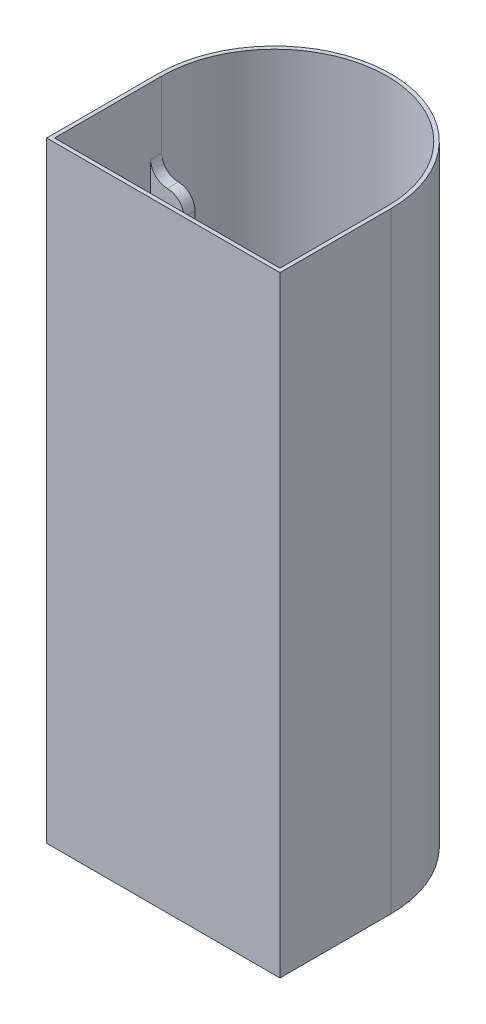
ISO-10303-21;
HEADER;
FILE_DESCRIPTION(('STEP AP214'),'2;1');
FILE_NAME('part.step','',(''),(''),'','','');
FILE_SCHEMA(('AUTOMOTIVE_DESIGN { 1 0 10303 214 1 1 1 1 }'));
ENDSEC;
DATA;
#1=APPLICATION_CONTEXT('core data for automotive mechanical design processes');
#2=APPLICATION_PROTOCOL_DEFINITION('international standard','automotive_design',2000,#1);
#3=PRODUCT_CONTEXT('',#1,'mechanical');
#4=PRODUCT('Part','Part','',(#3));
#5=PRODUCT_RELATED_PRODUCT_CATEGORY('part','',(#4));
#6=PRODUCT_DEFINITION_FORMATION('','',#4);
#7=PRODUCT_DEFINITION_CONTEXT('part definition',#1,'design');
#8=PRODUCT_DEFINITION('design','',#6,#7);
#9=PRODUCT_DEFINITION_SHAPE('','',#8);
#10=(LENGTH_UNIT() NAMED_UNIT(*) SI_UNIT(.MILLI.,.METRE.));
#11=(NAMED_UNIT(*) PLANE_ANGLE_UNIT() SI_UNIT($,.RADIAN.));
#12=(NAMED_UNIT(*) SI_UNIT($,.STERADIAN.) SOLID_ANGLE_UNIT());
#13=UNCERTAINTY_MEASURE_WITH_UNIT(LENGTH_MEASURE(1.E-05),#10,'distance_accuracy_value','');
#14=(GEOMETRIC_REPRESENTATION_CONTEXT(3) GLOBAL_UNCERTAINTY_ASSIGNED_CONTEXT((#13)) GLOBAL_UNIT_ASSIGNED_CONTEXT((#10,
#11,#12)) REPRESENTATION_CONTEXT('',''));
#15=CARTESIAN_POINT('',(0.,0.,0.));
#16=DIRECTION('',(0.,0.,1.));
#17=DIRECTION('',(1.,0.,0.));
#18=AXIS2_PLACEMENT_3D('',#15,#16,#17);
#19=CARTESIAN_POINT('',(0.416906474820143,0.700000000000006,-18.2922661870504));
#20=DIRECTION('',(0.,0.,1.));
#21=DIRECTION('',(1.,0.,0.));
#22=AXIS2_PLACEMENT_3D('',#19,#20,#21);
#23=PLANE('',#22);
#24=DIRECTION('',(0.,1.,0.));
#25=VECTOR('',#24,1.);
#26=CARTESIAN_POINT('',(-5.58309352517986,0.700000000000006,-18.2922661870504));
#27=LINE('',#26,#25);
#28=CARTESIAN_POINT('',(-5.58309352517986,0.700000000000006,-18.2922661870504));
#29=VERTEX_POINT('',#28);
#30=CARTESIAN_POINT('',(-5.58309352517986,92.,-18.2922661870504));
#31=VERTEX_POINT('',#30);
#32=EDGE_CURVE('E154',#29,#31,#27,.T.);
#33=ORIENTED_EDGE('',*,*,#32,.T.);
#34=CARTESIAN_POINT('',(-2.58309352517986,92.,-18.2922661870504));
#35=DIRECTION('',(0.,0.,1.));
#36=DIRECTION('',(1.,0.,0.));
#37=AXIS2_PLACEMENT_3D('',#34,#35,#36);
#38=CIRCLE('',#37,3.);
#39=CARTESIAN_POINT('',(-2.58309352517986,95.,-18.2922661870504));
#40=VERTEX_POINT('',#39);
#41=EDGE_CURVE('E59',#31,#40,#38,.F.);
#42=ORIENTED_EDGE('',*,*,#41,.T.);
#43=CARTESIAN_POINT('',(-2.58309352517986,98.,-18.2922661870504));
#44=DIRECTION('',(0.,0.,1.));
#45=DIRECTION('',(1.,0.,0.));
#46=AXIS2_PLACEMENT_3D('',#43,#44,#45);
#47=CIRCLE('',#46,3.);
#48=CARTESIAN_POINT('',(0.416906474820143,98.,-18.2922661870504));
#49=VERTEX_POINT('',#48);
#50=EDGE_CURVE('E42',#40,#49,#47,.T.);
#51=ORIENTED_EDGE('',*,*,#50,.T.);
#52=DIRECTION('',(0.,1.,0.));
#53=VECTOR('',#52,1.);
#54=CARTESIAN_POINT('',(0.416906474820143,0.700000000000006,-18.2922661870504));
#55=LINE('',#54,#53);
#56=CARTESIAN_POINT('',(0.416906474820143,0.700000000000006,-18.2922661870504));
#57=VERTEX_POINT('',#56);
#58=EDGE_CURVE('E50',#57,#49,#55,.T.);
#59=ORIENTED_EDGE('',*,*,#58,.F.);
#60=DIRECTION('',(1.,0.,0.));
#61=VECTOR('',#60,1.);
#62=CARTESIAN_POINT('',(0.416906474820143,0.700000000000006,-18.2922661870504));
#63=LINE('',#62,#61);
#64=EDGE_CURVE('E198',#29,#57,#63,.T.);
#65=ORIENTED_EDGE('',*,*,#64,.F.);
#66=EDGE_LOOP('',(#33,#42,#51,#59,#65));
#67=FACE_BOUND('',#66,.T.);
#68=ADVANCED_FACE('F33',(#67),#23,.F.);
#69=CARTESIAN_POINT('',(-5.58309352517986,0.700000000000006,-18.2922661870504));
#70=DIRECTION('',(1.,0.,0.));
#71=DIRECTION('',(0.,0.,-1.));
#72=AXIS2_PLACEMENT_3D('',#69,#70,#71);
#73=PLANE('',#72);
#74=DIRECTION('',(0.,1.,0.));
#75=VECTOR('',#74,1.);
#76=CARTESIAN_POINT('',(-5.58309352517986,0.700000000000006,-16.2922661870504));
#77=LINE('',#76,#75);
#78=CARTESIAN_POINT('',(-5.58309352517986,0.700000000000006,-16.2922661870504));
#79=VERTEX_POINT('',#78);
#80=CARTESIAN_POINT('',(-5.58309352517986,92.,-16.2922661870504));
#81=VERTEX_POINT('',#80);
#82=EDGE_CURVE('E137',#79,#81,#77,.T.);
#83=ORIENTED_EDGE('',*,*,#82,.T.);
#84=DIRECTION('',(0.,0.,1.));
#85=VECTOR('',#84,1.);
#86=CARTESIAN_POINT('',(-5.58309352517986,92.,-18.2922661870504));
#87=LINE('',#86,#85);
#88=EDGE_CURVE('E144',#81,#31,#87,.F.);
#89=ORIENTED_EDGE('',*,*,#88,.T.);
#90=ORIENTED_EDGE('',*,*,#32,.F.);
#91=DIRECTION('',(0.,0.,-1.));
#92=VECTOR('',#91,1.);
#93=CARTESIAN_POINT('',(-5.58309352517986,0.700000000000006,-18.2922661870504));
#94=LINE('',#93,#92);
#95=EDGE_CURVE('E152',#79,#29,#94,.T.);
#96=ORIENTED_EDGE('',*,*,#95,.F.);
#97=EDGE_LOOP('',(#83,#89,#90,#96));
#98=FACE_BOUND('',#97,.T.);
#99=ADVANCED_FACE('F149',(#98),#73,.F.);
#100=CARTESIAN_POINT('',(-5.58309352517986,0.700000000000006,-16.2922661870504));
#101=DIRECTION('',(0.,0.,-1.));
#102=DIRECTION('',(-1.,0.,0.));
#103=AXIS2_PLACEMENT_3D('',#100,#101,#102);
#104=PLANE('',#103);
#105=DIRECTION('',(0.,1.,0.));
#106=VECTOR('',#105,1.);
#107=CARTESIAN_POINT('',(0.416906474820142,0.700000000000006,-16.2922661870504));
#108=LINE('',#107,#106);
#109=CARTESIAN_POINT('',(0.416906474820142,0.700000000000006,-16.2922661870504));
#110=VERTEX_POINT('',#109);
#111=CARTESIAN_POINT('',(0.416906474820142,98.,-16.2922661870504));
#112=VERTEX_POINT('',#111);
#113=EDGE_CURVE('E155',#110,#112,#108,.T.);
#114=ORIENTED_EDGE('',*,*,#113,.T.);
#115=CARTESIAN_POINT('',(-2.58309352517986,98.,-16.2922661870504));
#116=DIRECTION('',(0.,0.,-1.));
#117=DIRECTION('',(-1.,0.,0.));
#118=AXIS2_PLACEMENT_3D('',#115,#116,#117);
#119=CIRCLE('',#118,3.);
#120=CARTESIAN_POINT('',(-2.58309352517986,95.,-16.2922661870504));
#121=VERTEX_POINT('',#120);
#122=EDGE_CURVE('E11',#112,#121,#119,.T.);
#123=ORIENTED_EDGE('',*,*,#122,.T.);
#124=CARTESIAN_POINT('',(-2.58309352517986,92.,-16.2922661870504));
#125=DIRECTION('',(0.,0.,-1.));
#126=DIRECTION('',(-1.,0.,0.));
#127=AXIS2_PLACEMENT_3D('',#124,#125,#126);
#128=CIRCLE('',#127,3.);
#129=EDGE_CURVE('E132',#121,#81,#128,.F.);
#130=ORIENTED_EDGE('',*,*,#129,.T.);
#131=ORIENTED_EDGE('',*,*,#82,.F.);
#132=DIRECTION('',(-1.,0.,0.));
#133=VECTOR('',#132,1.);
#134=CARTESIAN_POINT('',(-5.58309352517986,0.700000000000006,-16.2922661870504));
#135=LINE('',#134,#133);
#136=EDGE_CURVE('E218',#110,#79,#135,.T.);
#137=ORIENTED_EDGE('',*,*,#136,.F.);
#138=EDGE_LOOP('',(#114,#123,#130,#131,#137));
#139=FACE_BOUND('',#138,.T.);
#140=ADVANCED_FACE('F134',(#139),#104,.F.);
#141=CARTESIAN_POINT('',(0.416906474820143,0.700000000000006,-11.2922661870504));
#142=DIRECTION('',(0.,0.,1.));
#143=DIRECTION('',(1.,0.,0.));
#144=AXIS2_PLACEMENT_3D('',#141,#142,#143);
#145=PLANE('',#144);
#146=DIRECTION('',(0.,1.,0.));
#147=VECTOR('',#146,1.);
#148=CARTESIAN_POINT('',(-5.58309352517986,0.700000000000006,-11.2922661870504));
#149=LINE('',#148,#147);
#150=CARTESIAN_POINT('',(-5.58309352517986,0.700000000000006,-11.2922661870504));
#151=VERTEX_POINT('',#150);
#152=CARTESIAN_POINT('',(-5.58309352517986,92.,-11.2922661870504));
#153=VERTEX_POINT('',#152);
#154=EDGE_CURVE('E237',#151,#153,#149,.T.);
#155=ORIENTED_EDGE('',*,*,#154,.T.);
#156=CARTESIAN_POINT('',(-2.58309352517986,92.,-11.2922661870504));
#157=DIRECTION('',(0.,0.,1.));
#158=DIRECTION('',(1.,0.,0.));
#159=AXIS2_PLACEMENT_3D('',#156,#157,#158);
#160=CIRCLE('',#159,3.);
#161=CARTESIAN_POINT('',(-2.58309352517986,95.,-11.2922661870504));
#162=VERTEX_POINT('',#161);
#163=EDGE_CURVE('E145',#153,#162,#160,.F.);
#164=ORIENTED_EDGE('',*,*,#163,.T.);
#165=CARTESIAN_POINT('',(-2.58309352517986,98.,-11.2922661870504));
#166=DIRECTION('',(0.,0.,1.));
#167=DIRECTION('',(1.,0.,0.));
#168=AXIS2_PLACEMENT_3D('',#165,#166,#167);
#169=CIRCLE('',#168,3.);
#170=CARTESIAN_POINT('',(0.416906474820143,98.,-11.2922661870504));
#171=VERTEX_POINT('',#170);
#172=EDGE_CURVE('E172',#162,#171,#169,.T.);
#173=ORIENTED_EDGE('',*,*,#172,.T.);
#174=DIRECTION('',(0.,1.,0.));
#175=VECTOR('',#174,1.);
#176=CARTESIAN_POINT('',(0.416906474820143,0.700000000000006,-11.2922661870504));
#177=LINE('',#176,#175);
#178=CARTESIAN_POINT('',(0.416906474820143,0.700000000000006,-11.2922661870504));
#179=VERTEX_POINT('',#178);
#180=EDGE_CURVE('E235',#179,#171,#177,.T.);
#181=ORIENTED_EDGE('',*,*,#180,.F.);
#182=DIRECTION('',(1.,0.,0.));
#183=VECTOR('',#182,1.);
#184=CARTESIAN_POINT('',(0.416906474820143,0.700000000000006,-11.2922661870504));
#185=LINE('',#184,#183);
#186=EDGE_CURVE('E356',#151,#179,#185,.T.);
#187=ORIENTED_EDGE('',*,*,#186,.F.);
#188=EDGE_LOOP('',(#155,#164,#173,#181,#187));
#189=FACE_BOUND('',#188,.T.);
#190=ADVANCED_FACE('F333',(#189),#145,.F.);
#191=CARTESIAN_POINT('',(-5.58309352517986,0.700000000000006,-11.2922661870504));
#192=DIRECTION('',(1.,0.,0.));
#193=DIRECTION('',(0.,0.,-1.));
#194=AXIS2_PLACEMENT_3D('',#191,#192,#193);
#195=PLANE('',#194);
#196=DIRECTION('',(0.,1.,0.));
#197=VECTOR('',#196,1.);
#198=CARTESIAN_POINT('',(-5.58309352517986,0.700000000000006,-9.29226618705036));
#199=LINE('',#198,#197);
#200=CARTESIAN_POINT('',(-5.58309352517986,0.700000000000006,-9.29226618705036));
#201=VERTEX_POINT('',#200);
#202=CARTESIAN_POINT('',(-5.58309352517986,92.,-9.29226618705036));
#203=VERTEX_POINT('',#202);
#204=EDGE_CURVE('E240',#201,#203,#199,.T.);
#205=ORIENTED_EDGE('',*,*,#204,.T.);
#206=DIRECTION('',(0.,0.,1.));
#207=VECTOR('',#206,1.);
#208=CARTESIAN_POINT('',(-5.58309352517986,92.,-11.2922661870504));
#209=LINE('',#208,#207);
#210=EDGE_CURVE('E330',#203,#153,#209,.F.);
#211=ORIENTED_EDGE('',*,*,#210,.T.);
#212=ORIENTED_EDGE('',*,*,#154,.F.);
#213=DIRECTION('',(0.,0.,-1.));
#214=VECTOR('',#213,1.);
#215=CARTESIAN_POINT('',(-5.58309352517986,0.700000000000006,-11.2922661870504));
#216=LINE('',#215,#214);
#217=EDGE_CURVE('E444',#201,#151,#216,.T.);
#218=ORIENTED_EDGE('',*,*,#217,.F.);
#219=EDGE_LOOP('',(#205,#211,#212,#218));
#220=FACE_BOUND('',#219,.T.);
#221=ADVANCED_FACE('F487',(#220),#195,.F.);
#222=CARTESIAN_POINT('',(-5.58309352517986,0.700000000000006,-9.29226618705036));
#223=DIRECTION('',(0.,0.,-1.));
#224=DIRECTION('',(-1.,0.,0.));
#225=AXIS2_PLACEMENT_3D('',#222,#223,#224);
#226=PLANE('',#225);
#227=DIRECTION('',(0.,1.,0.));
#228=VECTOR('',#227,1.);
#229=CARTESIAN_POINT('',(0.416906474820143,0.700000000000006,-9.29226618705036));
#230=LINE('',#229,#228);
#231=CARTESIAN_POINT('',(0.416906474820143,0.700000000000006,-9.29226618705036));
#232=VERTEX_POINT('',#231);
#233=CARTESIAN_POINT('',(0.416906474820143,98.,-9.29226618705036));
#234=VERTEX_POINT('',#233);
#235=EDGE_CURVE('E243',#232,#234,#230,.T.);
#236=ORIENTED_EDGE('',*,*,#235,.T.);
#237=CARTESIAN_POINT('',(-2.58309352517986,98.,-9.29226618705036));
#238=DIRECTION('',(0.,0.,-1.));
#239=DIRECTION('',(-1.,0.,0.));
#240=AXIS2_PLACEMENT_3D('',#237,#238,#239);
#241=CIRCLE('',#240,3.);
#242=CARTESIAN_POINT('',(-2.58309352517986,95.,-9.29226618705036));
#243=VERTEX_POINT('',#242);
#244=EDGE_CURVE('E175',#234,#243,#241,.T.);
#245=ORIENTED_EDGE('',*,*,#244,.T.);
#246=CARTESIAN_POINT('',(-2.58309352517986,92.,-9.29226618705036));
#247=DIRECTION('',(0.,0.,-1.));
#248=DIRECTION('',(-1.,0.,0.));
#249=AXIS2_PLACEMENT_3D('',#246,#247,#248);
#250=CIRCLE('',#249,3.);
#251=EDGE_CURVE('E328',#243,#203,#250,.F.);
#252=ORIENTED_EDGE('',*,*,#251,.T.);
#253=ORIENTED_EDGE('',*,*,#204,.F.);
#254=DIRECTION('',(-1.,0.,0.));
#255=VECTOR('',#254,1.);
#256=CARTESIAN_POINT('',(-5.58309352517986,0.700000000000006,-9.29226618705036));
#257=LINE('',#256,#255);
#258=EDGE_CURVE('E441',#232,#201,#257,.T.);
#259=ORIENTED_EDGE('',*,*,#258,.F.);
#260=EDGE_LOOP('',(#236,#245,#252,#253,#259));
#261=FACE_BOUND('',#260,.T.);
#262=ADVANCED_FACE('F485',(#261),#226,.F.);
#263=CARTESIAN_POINT('',(-34.1830935251799,0.700000000000006,-9.29226618705036));
#264=DIRECTION('',(0.,0.,-1.));
#265=DIRECTION('',(-1.,0.,0.));
#266=AXIS2_PLACEMENT_3D('',#263,#264,#265);
#267=PLANE('',#266);
#268=DIRECTION('',(0.,1.,0.));
#269=VECTOR('',#268,1.);
#270=CARTESIAN_POINT('',(-34.1830935251799,0.700000000000006,-9.29226618705036));
#271=LINE('',#270,#269);
#272=CARTESIAN_POINT('',(-34.1830935251799,0.700000000000006,-9.29226618705036));
#273=VERTEX_POINT('',#272);
#274=CARTESIAN_POINT('',(-34.1830935251799,92.,-9.29226618705036));
#275=VERTEX_POINT('',#274);
#276=EDGE_CURVE('E253',#273,#275,#271,.T.);
#277=ORIENTED_EDGE('',*,*,#276,.T.);
#278=CARTESIAN_POINT('',(-37.1830935251799,92.,-9.29226618705036));
#279=DIRECTION('',(0.,0.,-1.));
#280=DIRECTION('',(-1.,0.,0.));
#281=AXIS2_PLACEMENT_3D('',#278,#279,#280);
#282=CIRCLE('',#281,3.);
#283=CARTESIAN_POINT('',(-37.1830935251799,95.,-9.29226618705036));
#284=VERTEX_POINT('',#283);
#285=EDGE_CURVE('E84',#275,#284,#282,.F.);
#286=ORIENTED_EDGE('',*,*,#285,.T.);
#287=CARTESIAN_POINT('',(-37.1830935251799,98.,-9.29226618705036));
#288=DIRECTION('',(0.,0.,-1.));
#289=DIRECTION('',(-1.,0.,0.));
#290=AXIS2_PLACEMENT_3D('',#287,#288,#289);
#291=CIRCLE('',#290,3.);
#292=CARTESIAN_POINT('',(-40.1830935251799,98.,-9.29226618705036));
#293=VERTEX_POINT('',#292);
#294=EDGE_CURVE('E159',#284,#293,#291,.T.);
#295=ORIENTED_EDGE('',*,*,#294,.T.);
#296=DIRECTION('',(0.,1.,0.));
#297=VECTOR('',#296,1.);
#298=CARTESIAN_POINT('',(-40.1830935251799,0.700000000000006,-9.29226618705036));
#299=LINE('',#298,#297);
#300=CARTESIAN_POINT('',(-40.1830935251799,0.700000000000006,-9.29226618705036));
#301=VERTEX_POINT('',#300);
#302=EDGE_CURVE('E251',#301,#293,#299,.T.);
#303=ORIENTED_EDGE('',*,*,#302,.F.);
#304=DIRECTION('',(-1.,0.,0.));
#305=VECTOR('',#304,1.);
#306=CARTESIAN_POINT('',(-34.1830935251799,0.700000000000006,-9.29226618705036));
#307=LINE('',#306,#305);
#308=EDGE_CURVE('E419',#273,#301,#307,.T.);
#309=ORIENTED_EDGE('',*,*,#308,.F.);
#310=EDGE_LOOP('',(#277,#286,#295,#303,#309));
#311=FACE_BOUND('',#310,.T.);
#312=ADVANCED_FACE('F413',(#311),#267,.F.);
#313=CARTESIAN_POINT('',(-34.1830935251799,0.700000000000006,-11.2922661870504));
#314=DIRECTION('',(-1.,0.,0.));
#315=DIRECTION('',(0.,0.,1.));
#316=AXIS2_PLACEMENT_3D('',#313,#314,#315);
#317=PLANE('',#316);
#318=DIRECTION('',(0.,1.,0.));
#319=VECTOR('',#318,1.);
#320=CARTESIAN_POINT('',(-34.1830935251799,0.700000000000006,-11.2922661870504));
#321=LINE('',#320,#319);
#322=CARTESIAN_POINT('',(-34.1830935251799,0.700000000000006,-11.2922661870504));
#323=VERTEX_POINT('',#322);
#324=CARTESIAN_POINT('',(-34.1830935251799,92.,-11.2922661870504));
#325=VERTEX_POINT('',#324);
#326=EDGE_CURVE('E255',#323,#325,#321,.T.);
#327=ORIENTED_EDGE('',*,*,#326,.T.);
#328=DIRECTION('',(0.,0.,-1.));
#329=VECTOR('',#328,1.);
#330=CARTESIAN_POINT('',(-34.1830935251799,92.,-9.29226618705036));
#331=LINE('',#330,#329);
#332=EDGE_CURVE('E308',#325,#275,#331,.F.);
#333=ORIENTED_EDGE('',*,*,#332,.T.);
#334=ORIENTED_EDGE('',*,*,#276,.F.);
#335=DIRECTION('',(0.,0.,1.));
#336=VECTOR('',#335,1.);
#337=CARTESIAN_POINT('',(-34.1830935251799,0.700000000000006,-11.2922661870504));
#338=LINE('',#337,#336);
#339=EDGE_CURVE('E406',#323,#273,#338,.T.);
#340=ORIENTED_EDGE('',*,*,#339,.F.);
#341=EDGE_LOOP('',(#327,#333,#334,#340));
#342=FACE_BOUND('',#341,.T.);
#343=ADVANCED_FACE('F403',(#342),#317,.F.);
#344=CARTESIAN_POINT('',(-40.1830935251799,0.700000000000006,-11.2922661870504));
#345=DIRECTION('',(0.,0.,1.));
#346=DIRECTION('',(1.,0.,0.));
#347=AXIS2_PLACEMENT_3D('',#344,#345,#346);
#348=PLANE('',#347);
#349=DIRECTION('',(0.,1.,0.));
#350=VECTOR('',#349,1.);
#351=CARTESIAN_POINT('',(-40.1830935251799,0.700000000000006,-11.2922661870504));
#352=LINE('',#351,#350);
#353=CARTESIAN_POINT('',(-40.1830935251799,0.700000000000006,-11.2922661870504));
#354=VERTEX_POINT('',#353);
#355=CARTESIAN_POINT('',(-40.1830935251799,98.,-11.2922661870504));
#356=VERTEX_POINT('',#355);
#357=EDGE_CURVE('E258',#354,#356,#352,.T.);
#358=ORIENTED_EDGE('',*,*,#357,.T.);
#359=CARTESIAN_POINT('',(-37.1830935251799,98.,-11.2922661870504));
#360=DIRECTION('',(0.,0.,1.));
#361=DIRECTION('',(1.,0.,0.));
#362=AXIS2_PLACEMENT_3D('',#359,#360,#361);
#363=CIRCLE('',#362,3.);
#364=CARTESIAN_POINT('',(-37.1830935251799,95.,-11.2922661870504));
#365=VERTEX_POINT('',#364);
#366=EDGE_CURVE('E164',#356,#365,#363,.T.);
#367=ORIENTED_EDGE('',*,*,#366,.T.);
#368=CARTESIAN_POINT('',(-37.1830935251799,92.,-11.2922661870504));
#369=DIRECTION('',(0.,0.,1.));
#370=DIRECTION('',(1.,0.,0.));
#371=AXIS2_PLACEMENT_3D('',#368,#369,#370);
#372=CIRCLE('',#371,3.);
#373=EDGE_CURVE('E302',#365,#325,#372,.F.);
#374=ORIENTED_EDGE('',*,*,#373,.T.);
#375=ORIENTED_EDGE('',*,*,#326,.F.);
#376=DIRECTION('',(1.,0.,0.));
#377=VECTOR('',#376,1.);
#378=CARTESIAN_POINT('',(-40.1830935251799,0.700000000000006,-11.2922661870504));
#379=LINE('',#378,#377);
#380=EDGE_CURVE('E433',#354,#323,#379,.T.);
#381=ORIENTED_EDGE('',*,*,#380,.F.);
#382=EDGE_LOOP('',(#358,#367,#374,#375,#381));
#383=FACE_BOUND('',#382,.T.);
#384=ADVANCED_FACE('F394',(#383),#348,.F.);
#385=CARTESIAN_POINT('',(-34.1830935251799,0.700000000000006,-16.2922661870504));
#386=DIRECTION('',(0.,0.,-1.));
#387=DIRECTION('',(-1.,0.,0.));
#388=AXIS2_PLACEMENT_3D('',#385,#386,#387);
#389=PLANE('',#388);
#390=DIRECTION('',(0.,1.,0.));
#391=VECTOR('',#390,1.);
#392=CARTESIAN_POINT('',(-34.1830935251799,0.700000000000006,-16.2922661870504));
#393=LINE('',#392,#391);
#394=CARTESIAN_POINT('',(-34.1830935251799,0.700000000000006,-16.2922661870504));
#395=VERTEX_POINT('',#394);
#396=CARTESIAN_POINT('',(-34.1830935251799,92.,-16.2922661870504));
#397=VERTEX_POINT('',#396);
#398=EDGE_CURVE('E262',#395,#397,#393,.T.);
#399=ORIENTED_EDGE('',*,*,#398,.T.);
#400=CARTESIAN_POINT('',(-37.1830935251799,92.,-16.2922661870504));
#401=DIRECTION('',(0.,0.,-1.));
#402=DIRECTION('',(-1.,0.,0.));
#403=AXIS2_PLACEMENT_3D('',#400,#401,#402);
#404=CIRCLE('',#403,3.);
#405=CARTESIAN_POINT('',(-37.1830935251799,95.,-16.2922661870504));
#406=VERTEX_POINT('',#405);
#407=EDGE_CURVE('E322',#397,#406,#404,.F.);
#408=ORIENTED_EDGE('',*,*,#407,.T.);
#409=CARTESIAN_POINT('',(-37.1830935251799,98.,-16.2922661870504));
#410=DIRECTION('',(0.,0.,-1.));
#411=DIRECTION('',(-1.,0.,0.));
#412=AXIS2_PLACEMENT_3D('',#409,#410,#411);
#413=CIRCLE('',#412,3.);
#414=CARTESIAN_POINT('',(-40.1830935251799,98.,-16.2922661870504));
#415=VERTEX_POINT('',#414);
#416=EDGE_CURVE('E167',#406,#415,#413,.T.);
#417=ORIENTED_EDGE('',*,*,#416,.T.);
#418=DIRECTION('',(0.,1.,0.));
#419=VECTOR('',#418,1.);
#420=CARTESIAN_POINT('',(-40.1830935251799,0.700000000000006,-16.2922661870504));
#421=LINE('',#420,#419);
#422=CARTESIAN_POINT('',(-40.1830935251799,0.700000000000006,-16.2922661870504));
#423=VERTEX_POINT('',#422);
#424=EDGE_CURVE('E260',#423,#415,#421,.T.);
#425=ORIENTED_EDGE('',*,*,#424,.F.);
#426=DIRECTION('',(-1.,0.,0.));
#427=VECTOR('',#426,1.);
#428=CARTESIAN_POINT('',(-34.1830935251799,0.700000000000006,-16.2922661870504));
#429=LINE('',#428,#427);
#430=EDGE_CURVE('E461',#395,#423,#429,.T.);
#431=ORIENTED_EDGE('',*,*,#430,.F.);
#432=EDGE_LOOP('',(#399,#408,#417,#425,#431));
#433=FACE_BOUND('',#432,.T.);
#434=ADVANCED_FACE('F509',(#433),#389,.F.);
#435=CARTESIAN_POINT('',(-34.1830935251799,0.700000000000006,-18.2922661870504));
#436=DIRECTION('',(-1.,0.,0.));
#437=DIRECTION('',(0.,0.,1.));
#438=AXIS2_PLACEMENT_3D('',#435,#436,#437);
#439=PLANE('',#438);
#440=DIRECTION('',(0.,1.,0.));
#441=VECTOR('',#440,1.);
#442=CARTESIAN_POINT('',(-34.1830935251799,0.700000000000006,-18.2922661870504));
#443=LINE('',#442,#441);
#444=CARTESIAN_POINT('',(-34.1830935251799,0.700000000000006,-18.2922661870504));
#445=VERTEX_POINT('',#444);
#446=CARTESIAN_POINT('',(-34.1830935251799,92.,-18.2922661870504));
#447=VERTEX_POINT('',#446);
#448=EDGE_CURVE('E216',#445,#447,#443,.T.);
#449=ORIENTED_EDGE('',*,*,#448,.T.);
#450=DIRECTION('',(0.,0.,-1.));
#451=VECTOR('',#450,1.);
#452=CARTESIAN_POINT('',(-34.1830935251799,92.,-16.2922661870504));
#453=LINE('',#452,#451);
#454=EDGE_CURVE('E319',#447,#397,#453,.F.);
#455=ORIENTED_EDGE('',*,*,#454,.T.);
#456=ORIENTED_EDGE('',*,*,#398,.F.);
#457=DIRECTION('',(0.,0.,1.));
#458=VECTOR('',#457,1.);
#459=CARTESIAN_POINT('',(-34.1830935251799,0.700000000000006,-18.2922661870504));
#460=LINE('',#459,#458);
#461=EDGE_CURVE('E458',#445,#395,#460,.T.);
#462=ORIENTED_EDGE('',*,*,#461,.F.);
#463=EDGE_LOOP('',(#449,#455,#456,#462));
#464=FACE_BOUND('',#463,.T.);
#465=ADVANCED_FACE('F506',(#464),#439,.F.);
#466=CARTESIAN_POINT('',(-40.1830935251799,0.700000000000006,-18.2922661870504));
#467=DIRECTION('',(0.,0.,1.));
#468=DIRECTION('',(1.,0.,0.));
#469=AXIS2_PLACEMENT_3D('',#466,#467,#468);
#470=PLANE('',#469);
#471=DIRECTION('',(0.,1.,0.));
#472=VECTOR('',#471,1.);
#473=CARTESIAN_POINT('',(-40.1830935251799,0.700000000000006,-18.2922661870504));
#474=LINE('',#473,#472);
#475=CARTESIAN_POINT('',(-40.1830935251799,0.700000000000006,-18.2922661870504));
#476=VERTEX_POINT('',#475);
#477=CARTESIAN_POINT('',(-40.1830935251799,98.,-18.2922661870504));
#478=VERTEX_POINT('',#477);
#479=EDGE_CURVE('E72',#476,#478,#474,.T.);
#480=ORIENTED_EDGE('',*,*,#479,.T.);
#481=CARTESIAN_POINT('',(-37.1830935251799,98.,-18.2922661870504));
#482=DIRECTION('',(0.,0.,1.));
#483=DIRECTION('',(1.,0.,0.));
#484=AXIS2_PLACEMENT_3D('',#481,#482,#483);
#485=CIRCLE('',#484,3.);
#486=CARTESIAN_POINT('',(-37.1830935251799,95.,-18.2922661870504));
#487=VERTEX_POINT('',#486);
#488=EDGE_CURVE('E170',#478,#487,#485,.T.);
#489=ORIENTED_EDGE('',*,*,#488,.T.);
#490=CARTESIAN_POINT('',(-37.1830935251799,92.,-18.2922661870504));
#491=DIRECTION('',(0.,0.,1.));
#492=DIRECTION('',(1.,0.,0.));
#493=AXIS2_PLACEMENT_3D('',#490,#491,#492);
#494=CIRCLE('',#493,3.);
#495=EDGE_CURVE('E317',#487,#447,#494,.F.);
#496=ORIENTED_EDGE('',*,*,#495,.T.);
#497=ORIENTED_EDGE('',*,*,#448,.F.);
#498=DIRECTION('',(1.,0.,0.));
#499=VECTOR('',#498,1.);
#500=CARTESIAN_POINT('',(-40.1830935251799,0.700000000000006,-18.2922661870504));
#501=LINE('',#500,#499);
#502=EDGE_CURVE('E211',#476,#445,#501,.T.);
#503=ORIENTED_EDGE('',*,*,#502,.F.);
#504=EDGE_LOOP('',(#480,#489,#496,#497,#503));
#505=FACE_BOUND('',#504,.T.);
#506=ADVANCED_FACE('F510',(#505),#470,.F.);
#507=CARTESIAN_POINT('',(-40.8830935251799,110.,1.70773381294964));
#508=DIRECTION('',(0.,0.,-1.));
#509=DIRECTION('',(-1.,0.,0.));
#510=AXIS2_PLACEMENT_3D('',#507,#508,#509);
#511=PLANE('',#510);
#512=DIRECTION('',(1.,0.,0.));
#513=VECTOR('',#512,1.);
#514=CARTESIAN_POINT('',(-40.8830935251799,0.,1.70773381294964));
#515=LINE('',#514,#513);
#516=CARTESIAN_POINT('',(-40.8830935251799,0.,1.70773381294964));
#517=VERTEX_POINT('',#516);
#518=CARTESIAN_POINT('',(1.11690647482014,0.,1.70773381294964));
#519=VERTEX_POINT('',#518);
#520=EDGE_CURVE('E201',#517,#519,#515,.T.);
#521=ORIENTED_EDGE('',*,*,#520,.T.);
#522=DIRECTION('',(0.,-1.,0.));
#523=VECTOR('',#522,1.);
#524=CARTESIAN_POINT('',(1.11690647482014,110.,1.70773381294964));
#525=LINE('',#524,#523);
#526=CARTESIAN_POINT('',(1.11690647482014,110.,1.70773381294964));
#527=VERTEX_POINT('',#526);
#528=EDGE_CURVE('E299',#527,#519,#525,.T.);
#529=ORIENTED_EDGE('',*,*,#528,.F.);
#530=DIRECTION('',(1.,0.,0.));
#531=VECTOR('',#530,1.);
#532=CARTESIAN_POINT('',(-40.8830935251799,110.,1.70773381294964));
#533=LINE('',#532,#531);
#534=CARTESIAN_POINT('',(-40.8830935251799,110.,1.70773381294964));
#535=VERTEX_POINT('',#534);
#536=EDGE_CURVE('E267',#535,#527,#533,.T.);
#537=ORIENTED_EDGE('',*,*,#536,.F.);
#538=DIRECTION('',(0.,-1.,0.));
#539=VECTOR('',#538,1.);
#540=CARTESIAN_POINT('',(-40.8830935251799,110.,1.70773381294964));
#541=LINE('',#540,#539);
#542=EDGE_CURVE('E280',#535,#517,#541,.T.);
#543=ORIENTED_EDGE('',*,*,#542,.T.);
#544=EDGE_LOOP('',(#521,#529,#537,#543));
#545=FACE_BOUND('',#544,.T.);
#546=ADVANCED_FACE('F563',(#545),#511,.F.);
#547=CARTESIAN_POINT('',(1.11690647482014,110.,1.70773381294964));
#548=DIRECTION('',(-1.,0.,0.));
#549=DIRECTION('',(0.,0.,1.));
#550=AXIS2_PLACEMENT_3D('',#547,#548,#549);
#551=PLANE('',#550);
#552=DIRECTION('',(0.,0.,-1.));
#553=VECTOR('',#552,1.);
#554=CARTESIAN_POINT('',(1.11690647482014,0.,1.70773381294964));
#555=LINE('',#554,#553);
#556=CARTESIAN_POINT('',(1.11690647482014,0.,-18.2922661870504));
#557=VERTEX_POINT('',#556);
#558=EDGE_CURVE('E283',#519,#557,#555,.T.);
#559=ORIENTED_EDGE('',*,*,#558,.T.);
#560=DIRECTION('',(0.,-1.,0.));
#561=VECTOR('',#560,1.);
#562=CARTESIAN_POINT('',(1.11690647482014,110.,-18.2922661870504));
#563=LINE('',#562,#561);
#564=CARTESIAN_POINT('',(1.11690647482014,110.,-18.2922661870504));
#565=VERTEX_POINT('',#564);
#566=EDGE_CURVE('E296',#565,#557,#563,.T.);
#567=ORIENTED_EDGE('',*,*,#566,.F.);
#568=DIRECTION('',(0.,0.,-1.));
#569=VECTOR('',#568,1.);
#570=CARTESIAN_POINT('',(1.11690647482014,110.,1.70773381294964));
#571=LINE('',#570,#569);
#572=EDGE_CURVE('E270',#527,#565,#571,.T.);
#573=ORIENTED_EDGE('',*,*,#572,.F.);
#574=ORIENTED_EDGE('',*,*,#528,.T.);
#575=EDGE_LOOP('',(#559,#567,#573,#574));
#576=FACE_BOUND('',#575,.T.);
#577=ADVANCED_FACE('F579',(#576),#551,.F.);
#578=CARTESIAN_POINT('',(-19.8830935251799,110.,-18.2922661870504));
#579=DIRECTION('',(0.,-1.,0.));
#580=DIRECTION('',(0.,0.,-1.));
#581=AXIS2_PLACEMENT_3D('',#578,#579,#580);
#582=CYLINDRICAL_SURFACE('',#581,21.);
#583=CARTESIAN_POINT('',(-19.8830935251799,0.,-18.2922661870504));
#584=DIRECTION('',(0.,1.,0.));
#585=DIRECTION('',(0.,0.,1.));
#586=AXIS2_PLACEMENT_3D('',#583,#584,#585);
#587=CIRCLE('',#586,21.);
#588=CARTESIAN_POINT('',(-40.8830935251799,0.,-18.2922661870504));
#589=VERTEX_POINT('',#588);
#590=EDGE_CURVE('E286',#557,#589,#587,.T.);
#591=ORIENTED_EDGE('',*,*,#590,.T.);
#592=DIRECTION('',(0.,-1.,0.));
#593=VECTOR('',#592,1.);
#594=CARTESIAN_POINT('',(-40.8830935251799,110.,-18.2922661870504));
#595=LINE('',#594,#593);
#596=CARTESIAN_POINT('',(-40.8830935251799,110.,-18.2922661870504));
#597=VERTEX_POINT('',#596);
#598=EDGE_CURVE('E293',#597,#589,#595,.T.);
#599=ORIENTED_EDGE('',*,*,#598,.F.);
#600=CARTESIAN_POINT('',(-19.8830935251799,110.,-18.2922661870504));
#601=DIRECTION('',(0.,1.,0.));
#602=DIRECTION('',(0.,0.,1.));
#603=AXIS2_PLACEMENT_3D('',#600,#601,#602);
#604=CIRCLE('',#603,21.);
#605=EDGE_CURVE('E274',#565,#597,#604,.T.);
#606=ORIENTED_EDGE('',*,*,#605,.F.);
#607=ORIENTED_EDGE('',*,*,#566,.T.);
#608=EDGE_LOOP('',(#591,#599,#606,#607));
#609=FACE_BOUND('',#608,.T.);
#610=ADVANCED_FACE('F575',(#609),#582,.T.);
#611=CARTESIAN_POINT('',(-40.8830935251799,110.,1.70773381294964));
#612=DIRECTION('',(-1.,0.,0.));
#613=DIRECTION('',(0.,0.,1.));
#614=AXIS2_PLACEMENT_3D('',#611,#612,#613);
#615=PLANE('',#614);
#616=CARTESIAN_POINT('',(-40.8830935251799,55.,-4.95893285371703));
#617=DIRECTION('',(-1.,0.,0.));
#618=DIRECTION('',(0.,0.,1.));
#619=AXIS2_PLACEMENT_3D('',#616,#617,#618);
#620=CIRCLE('',#619,3.375);
#621=CARTESIAN_POINT('',(-40.8830935251799,55.,-1.58393285371703));
#622=VERTEX_POINT('',#621);
#623=EDGE_CURVE('E305',#622,#622,#620,.T.);
#624=ORIENTED_EDGE('',*,*,#623,.F.);
#625=EDGE_LOOP('',(#624));
#626=FACE_BOUND('',#625,.T.);
#627=DIRECTION('',(0.,0.,-1.));
#628=VECTOR('',#627,1.);
#629=CARTESIAN_POINT('',(-40.8830935251799,0.,1.70773381294964));
#630=LINE('',#629,#628);
#631=EDGE_CURVE('E271',#517,#589,#630,.T.);
#632=ORIENTED_EDGE('',*,*,#631,.F.);
#633=ORIENTED_EDGE('',*,*,#542,.F.);
#634=DIRECTION('',(0.,0.,-1.));
#635=VECTOR('',#634,1.);
#636=CARTESIAN_POINT('',(-40.8830935251799,110.,1.70773381294964));
#637=LINE('',#636,#635);
#638=EDGE_CURVE('E277',#535,#597,#637,.T.);
#639=ORIENTED_EDGE('',*,*,#638,.T.);
#640=ORIENTED_EDGE('',*,*,#598,.T.);
#641=EDGE_LOOP('',(#632,#633,#639,#640));
#642=FACE_BOUND('',#641,.T.);
#643=ADVANCED_FACE('F569',(#626,#642),#615,.T.);
#644=CARTESIAN_POINT('',(-19.8830935251799,110.,-18.2922661870504));
#645=DIRECTION('',(0.,1.,0.));
#646=DIRECTION('',(0.,0.,1.));
#647=AXIS2_PLACEMENT_3D('',#644,#645,#646);
#648=PLANE('',#647);
#649=DIRECTION('',(0.,0.,1.));
#650=VECTOR('',#649,1.);
#651=CARTESIAN_POINT('',(-40.1830935251799,110.,-16.2922661870504));
#652=LINE('',#651,#650);
#653=CARTESIAN_POINT('',(-40.1830935251799,110.,-18.2922661870504));
#654=VERTEX_POINT('',#653);
#655=CARTESIAN_POINT('',(-40.1830935251799,110.,1.00773381294964));
#656=VERTEX_POINT('',#655);
#657=EDGE_CURVE('E224',#654,#656,#652,.T.);
#658=ORIENTED_EDGE('',*,*,#657,.F.);
#659=CARTESIAN_POINT('',(-19.8830935251799,110.,-18.2922661870504));
#660=DIRECTION('',(0.,1.,0.));
#661=DIRECTION('',(0.,0.,1.));
#662=AXIS2_PLACEMENT_3D('',#659,#660,#661);
#663=CIRCLE('',#662,20.3);
#664=CARTESIAN_POINT('',(0.416906474820143,110.,-18.2922661870504));
#665=VERTEX_POINT('',#664);
#666=EDGE_CURVE('E222',#665,#654,#663,.T.);
#667=ORIENTED_EDGE('',*,*,#666,.F.);
#668=DIRECTION('',(0.,0.,-1.));
#669=VECTOR('',#668,1.);
#670=CARTESIAN_POINT('',(0.416906474820143,110.,-9.29226618705036));
#671=LINE('',#670,#669);
#672=CARTESIAN_POINT('',(0.416906474820143,110.,1.00773381294964));
#673=VERTEX_POINT('',#672);
#674=EDGE_CURVE('E212',#673,#665,#671,.T.);
#675=ORIENTED_EDGE('',*,*,#674,.F.);
#676=DIRECTION('',(1.,0.,0.));
#677=VECTOR('',#676,1.);
#678=CARTESIAN_POINT('',(-40.1830935251799,110.,1.00773381294964));
#679=LINE('',#678,#677);
#680=EDGE_CURVE('E228',#656,#673,#679,.T.);
#681=ORIENTED_EDGE('',*,*,#680,.F.);
#682=EDGE_LOOP('',(#658,#667,#675,#681));
#683=FACE_BOUND('',#682,.T.);
#684=ORIENTED_EDGE('',*,*,#536,.T.);
#685=ORIENTED_EDGE('',*,*,#572,.T.);
#686=ORIENTED_EDGE('',*,*,#605,.T.);
#687=ORIENTED_EDGE('',*,*,#638,.F.);
#688=EDGE_LOOP('',(#684,#685,#686,#687));
#689=FACE_BOUND('',#688,.T.);
#690=ADVANCED_FACE('F493',(#683,#689),#648,.T.);
#691=CARTESIAN_POINT('',(-19.8830935251799,0.,-18.2922661870504));
#692=DIRECTION('',(0.,1.,0.));
#693=DIRECTION('',(0.,0.,1.));
#694=AXIS2_PLACEMENT_3D('',#691,#692,#693);
#695=PLANE('',#694);
#696=ORIENTED_EDGE('',*,*,#520,.F.);
#697=ORIENTED_EDGE('',*,*,#631,.T.);
#698=ORIENTED_EDGE('',*,*,#590,.F.);
#699=ORIENTED_EDGE('',*,*,#558,.F.);
#700=EDGE_LOOP('',(#696,#697,#698,#699));
#701=FACE_BOUND('',#700,.T.);
#702=ADVANCED_FACE('F566',(#701),#695,.F.);
#703=CARTESIAN_POINT('',(-19.8830935251799,0.700000000000006,-18.2922661870504));
#704=DIRECTION('',(0.,1.,0.));
#705=DIRECTION('',(0.,0.,1.));
#706=AXIS2_PLACEMENT_3D('',#703,#704,#705);
#707=CYLINDRICAL_SURFACE('',#706,20.3);
#708=ORIENTED_EDGE('',*,*,#666,.T.);
#709=DIRECTION('',(0.,1.,0.));
#710=VECTOR('',#709,1.);
#711=CARTESIAN_POINT('',(-40.1830935251799,95.,-18.2922661870504));
#712=LINE('',#711,#710);
#713=EDGE_CURVE('E450',#478,#654,#712,.T.);
#714=ORIENTED_EDGE('',*,*,#713,.F.);
#715=ORIENTED_EDGE('',*,*,#479,.F.);
#716=CARTESIAN_POINT('',(-19.8830935251799,0.700000000000006,-18.2922661870504));
#717=DIRECTION('',(0.,1.,0.));
#718=DIRECTION('',(0.,0.,1.));
#719=AXIS2_PLACEMENT_3D('',#716,#717,#718);
#720=CIRCLE('',#719,20.3);
#721=EDGE_CURVE('E204',#57,#476,#720,.T.);
#722=ORIENTED_EDGE('',*,*,#721,.F.);
#723=ORIENTED_EDGE('',*,*,#58,.T.);
#724=DIRECTION('',(0.,1.,0.));
#725=VECTOR('',#724,1.);
#726=CARTESIAN_POINT('',(0.416906474820143,95.,-18.2922661870504));
#727=LINE('',#726,#725);
#728=EDGE_CURVE('E181',#49,#665,#727,.T.);
#729=ORIENTED_EDGE('',*,*,#728,.T.);
#730=EDGE_LOOP('',(#708,#714,#715,#722,#723,#729));
#731=FACE_BOUND('',#730,.T.);
#732=ADVANCED_FACE('F206',(#731),#707,.F.);
#733=CARTESIAN_POINT('',(0.416906474820142,0.700000000000006,-16.2922661870504));
#734=DIRECTION('',(1.,0.,0.));
#735=DIRECTION('',(0.,0.,-1.));
#736=AXIS2_PLACEMENT_3D('',#733,#734,#735);
#737=PLANE('',#736);
#738=ORIENTED_EDGE('',*,*,#180,.T.);
#739=DIRECTION('',(0.,0.,-1.));
#740=VECTOR('',#739,1.);
#741=CARTESIAN_POINT('',(0.416906474820142,98.,-16.2922661870504));
#742=LINE('',#741,#740);
#743=EDGE_CURVE('E325',#171,#234,#742,.F.);
#744=ORIENTED_EDGE('',*,*,#743,.T.);
#745=ORIENTED_EDGE('',*,*,#235,.F.);
#746=DIRECTION('',(0.,0.,-1.));
#747=VECTOR('',#746,1.);
#748=CARTESIAN_POINT('',(0.416906474820143,0.700000000000006,-9.29226618705036));
#749=LINE('',#748,#747);
#750=CARTESIAN_POINT('',(0.416906474820143,0.700000000000006,1.00773381294964));
#751=VERTEX_POINT('',#750);
#752=EDGE_CURVE('E438',#751,#232,#749,.T.);
#753=ORIENTED_EDGE('',*,*,#752,.F.);
#754=DIRECTION('',(0.,1.,0.));
#755=VECTOR('',#754,1.);
#756=CARTESIAN_POINT('',(0.416906474820143,0.700000000000006,1.00773381294964));
#757=LINE('',#756,#755);
#758=EDGE_CURVE('E245',#751,#673,#757,.T.);
#759=ORIENTED_EDGE('',*,*,#758,.T.);
#760=ORIENTED_EDGE('',*,*,#674,.T.);
#761=ORIENTED_EDGE('',*,*,#728,.F.);
#762=DIRECTION('',(0.,0.,-1.));
#763=VECTOR('',#762,1.);
#764=CARTESIAN_POINT('',(0.416906474820142,98.,-16.2922661870504));
#765=LINE('',#764,#763);
#766=EDGE_CURVE('E193',#49,#112,#765,.F.);
#767=ORIENTED_EDGE('',*,*,#766,.T.);
#768=ORIENTED_EDGE('',*,*,#113,.F.);
#769=DIRECTION('',(0.,0.,-1.));
#770=VECTOR('',#769,1.);
#771=CARTESIAN_POINT('',(0.416906474820142,0.700000000000006,-16.2922661870504));
#772=LINE('',#771,#770);
#773=EDGE_CURVE('E353',#179,#110,#772,.T.);
#774=ORIENTED_EDGE('',*,*,#773,.F.);
#775=EDGE_LOOP('',(#738,#744,#745,#753,#759,#760,#761,#767,#768,#774));
#776=FACE_BOUND('',#775,.T.);
#777=ADVANCED_FACE('F345',(#776),#737,.F.);
#778=CARTESIAN_POINT('',(-40.1830935251799,0.700000000000006,1.00773381294964));
#779=DIRECTION('',(0.,0.,1.));
#780=DIRECTION('',(1.,0.,0.));
#781=AXIS2_PLACEMENT_3D('',#778,#779,#780);
#782=PLANE('',#781);
#783=ORIENTED_EDGE('',*,*,#680,.T.);
#784=ORIENTED_EDGE('',*,*,#758,.F.);
#785=DIRECTION('',(1.,0.,0.));
#786=VECTOR('',#785,1.);
#787=CARTESIAN_POINT('',(-40.1830935251799,0.700000000000006,1.00773381294964));
#788=LINE('',#787,#786);
#789=CARTESIAN_POINT('',(-40.1830935251799,0.700000000000006,1.00773381294964));
#790=VERTEX_POINT('',#789);
#791=EDGE_CURVE('E430',#790,#751,#788,.T.);
#792=ORIENTED_EDGE('',*,*,#791,.F.);
#793=DIRECTION('',(0.,1.,0.));
#794=VECTOR('',#793,1.);
#795=CARTESIAN_POINT('',(-40.1830935251799,0.700000000000006,1.00773381294964));
#796=LINE('',#795,#794);
#797=EDGE_CURVE('E248',#790,#656,#796,.T.);
#798=ORIENTED_EDGE('',*,*,#797,.T.);
#799=EDGE_LOOP('',(#783,#784,#792,#798));
#800=FACE_BOUND('',#799,.T.);
#801=ADVANCED_FACE('F490',(#800),#782,.F.);
#802=CARTESIAN_POINT('',(-40.1830935251799,0.700000000000006,-9.29226618705036));
#803=DIRECTION('',(-1.,0.,0.));
#804=DIRECTION('',(0.,0.,1.));
#805=AXIS2_PLACEMENT_3D('',#802,#803,#804);
#806=PLANE('',#805);
#807=ORIENTED_EDGE('',*,*,#302,.T.);
#808=DIRECTION('',(0.,0.,1.));
#809=VECTOR('',#808,1.);
#810=CARTESIAN_POINT('',(-40.1830935251799,98.,-9.29226618705036));
#811=LINE('',#810,#809);
#812=EDGE_CURVE('E314',#293,#356,#811,.F.);
#813=ORIENTED_EDGE('',*,*,#812,.T.);
#814=ORIENTED_EDGE('',*,*,#357,.F.);
#815=DIRECTION('',(0.,0.,1.));
#816=VECTOR('',#815,1.);
#817=CARTESIAN_POINT('',(-40.1830935251799,0.700000000000006,-16.2922661870504));
#818=LINE('',#817,#816);
#819=EDGE_CURVE('E464',#423,#354,#818,.T.);
#820=ORIENTED_EDGE('',*,*,#819,.F.);
#821=ORIENTED_EDGE('',*,*,#424,.T.);
#822=DIRECTION('',(0.,0.,1.));
#823=VECTOR('',#822,1.);
#824=CARTESIAN_POINT('',(-40.1830935251799,98.,-9.29226618705036));
#825=LINE('',#824,#823);
#826=EDGE_CURVE('E312',#415,#478,#825,.F.);
#827=ORIENTED_EDGE('',*,*,#826,.T.);
#828=ORIENTED_EDGE('',*,*,#713,.T.);
#829=ORIENTED_EDGE('',*,*,#657,.T.);
#830=ORIENTED_EDGE('',*,*,#797,.F.);
#831=DIRECTION('',(0.,0.,1.));
#832=VECTOR('',#831,1.);
#833=CARTESIAN_POINT('',(-40.1830935251799,0.700000000000006,-9.29226618705036));
#834=LINE('',#833,#832);
#835=EDGE_CURVE('E425',#301,#790,#834,.T.);
#836=ORIENTED_EDGE('',*,*,#835,.F.);
#837=EDGE_LOOP('',(#807,#813,#814,#820,#821,#827,#828,#829,#830,#836));
#838=FACE_BOUND('',#837,.T.);
#839=CARTESIAN_POINT('',(-40.1830935251799,55.,-4.95893285371703));
#840=DIRECTION('',(-1.,0.,0.));
#841=DIRECTION('',(0.,0.,1.));
#842=AXIS2_PLACEMENT_3D('',#839,#840,#841);
#843=CIRCLE('',#842,3.375);
#844=CARTESIAN_POINT('',(-40.1830935251799,55.,-1.58393285371703));
#845=VERTEX_POINT('',#844);
#846=EDGE_CURVE('E225',#845,#845,#843,.T.);
#847=ORIENTED_EDGE('',*,*,#846,.T.);
#848=EDGE_LOOP('',(#847));
#849=FACE_BOUND('',#848,.T.);
#850=ADVANCED_FACE('F426',(#838,#849),#806,.F.);
#851=CARTESIAN_POINT('',(-19.8830935251799,0.700000000000006,-18.2922661870504));
#852=DIRECTION('',(0.,1.,0.));
#853=DIRECTION('',(0.,0.,1.));
#854=AXIS2_PLACEMENT_3D('',#851,#852,#853);
#855=PLANE('',#854);
#856=ORIENTED_EDGE('',*,*,#721,.T.);
#857=ORIENTED_EDGE('',*,*,#502,.T.);
#858=ORIENTED_EDGE('',*,*,#461,.T.);
#859=ORIENTED_EDGE('',*,*,#430,.T.);
#860=ORIENTED_EDGE('',*,*,#819,.T.);
#861=ORIENTED_EDGE('',*,*,#380,.T.);
#862=ORIENTED_EDGE('',*,*,#339,.T.);
#863=ORIENTED_EDGE('',*,*,#308,.T.);
#864=ORIENTED_EDGE('',*,*,#835,.T.);
#865=ORIENTED_EDGE('',*,*,#791,.T.);
#866=ORIENTED_EDGE('',*,*,#752,.T.);
#867=ORIENTED_EDGE('',*,*,#258,.T.);
#868=ORIENTED_EDGE('',*,*,#217,.T.);
#869=ORIENTED_EDGE('',*,*,#186,.T.);
#870=ORIENTED_EDGE('',*,*,#773,.T.);
#871=ORIENTED_EDGE('',*,*,#136,.T.);
#872=ORIENTED_EDGE('',*,*,#95,.T.);
#873=ORIENTED_EDGE('',*,*,#64,.T.);
#874=EDGE_LOOP('',(#856,#857,#858,#859,#860,#861,#862,#863,#864,#865,#866,#867,#868,#869,#870,
#871,#872,#873));
#875=FACE_BOUND('',#874,.T.);
#876=ADVANCED_FACE('F214',(#875),#855,.T.);
#877=CARTESIAN_POINT('',(-35.8830935251799,55.,-4.95893285371703));
#878=DIRECTION('',(-1.,0.,0.));
#879=DIRECTION('',(0.,0.,1.));
#880=AXIS2_PLACEMENT_3D('',#877,#878,#879);
#881=CYLINDRICAL_SURFACE('',#880,3.375);
#882=ORIENTED_EDGE('',*,*,#623,.T.);
#883=EDGE_LOOP('',(#882));
#884=FACE_BOUND('',#883,.T.);
#885=ORIENTED_EDGE('',*,*,#846,.F.);
#886=EDGE_LOOP('',(#885));
#887=FACE_BOUND('',#886,.T.);
#888=ADVANCED_FACE('F588',(#884,#887),#881,.F.);
#889=CARTESIAN_POINT('',(-37.1830935251799,98.,0.));
#890=DIRECTION('',(0.,0.,1.));
#891=DIRECTION('',(1.,0.,0.));
#892=AXIS2_PLACEMENT_3D('',#889,#890,#891);
#893=CYLINDRICAL_SURFACE('',#892,3.);
#894=ORIENTED_EDGE('',*,*,#812,.F.);
#895=ORIENTED_EDGE('',*,*,#294,.F.);
#896=DIRECTION('',(0.,0.,1.));
#897=VECTOR('',#896,1.);
#898=CARTESIAN_POINT('',(-37.1830935251799,95.,0.));
#899=LINE('',#898,#897);
#900=EDGE_CURVE('E178',#365,#284,#899,.T.);
#901=ORIENTED_EDGE('',*,*,#900,.F.);
#902=ORIENTED_EDGE('',*,*,#366,.F.);
#903=EDGE_LOOP('',(#894,#895,#901,#902));
#904=FACE_BOUND('',#903,.T.);
#905=ADVANCED_FACE('F411',(#904),#893,.F.);
#906=CARTESIAN_POINT('',(-37.1830935251799,92.,0.));
#907=DIRECTION('',(0.,0.,1.));
#908=DIRECTION('',(1.,0.,0.));
#909=AXIS2_PLACEMENT_3D('',#906,#907,#908);
#910=CYLINDRICAL_SURFACE('',#909,3.);
#911=ORIENTED_EDGE('',*,*,#285,.F.);
#912=ORIENTED_EDGE('',*,*,#332,.F.);
#913=ORIENTED_EDGE('',*,*,#373,.F.);
#914=ORIENTED_EDGE('',*,*,#900,.T.);
#915=EDGE_LOOP('',(#911,#912,#913,#914));
#916=FACE_BOUND('',#915,.T.);
#917=ADVANCED_FACE('F408',(#916),#910,.T.);
#918=CARTESIAN_POINT('',(-37.1830935251799,98.,0.));
#919=DIRECTION('',(0.,0.,1.));
#920=DIRECTION('',(1.,0.,0.));
#921=AXIS2_PLACEMENT_3D('',#918,#919,#920);
#922=CYLINDRICAL_SURFACE('',#921,3.);
#923=ORIENTED_EDGE('',*,*,#826,.F.);
#924=ORIENTED_EDGE('',*,*,#416,.F.);
#925=DIRECTION('',(0.,0.,1.));
#926=VECTOR('',#925,1.);
#927=CARTESIAN_POINT('',(-37.1830935251799,95.,0.));
#928=LINE('',#927,#926);
#929=EDGE_CURVE('E182',#487,#406,#928,.T.);
#930=ORIENTED_EDGE('',*,*,#929,.F.);
#931=ORIENTED_EDGE('',*,*,#488,.F.);
#932=EDGE_LOOP('',(#923,#924,#930,#931));
#933=FACE_BOUND('',#932,.T.);
#934=ADVANCED_FACE('F518',(#933),#922,.F.);
#935=CARTESIAN_POINT('',(-37.1830935251798,92.,1.29004770495141E-13));
#936=DIRECTION('',(0.,0.,1.));
#937=DIRECTION('',(1.,0.,0.));
#938=AXIS2_PLACEMENT_3D('',#935,#936,#937);
#939=CYLINDRICAL_SURFACE('',#938,3.);
#940=ORIENTED_EDGE('',*,*,#407,.F.);
#941=ORIENTED_EDGE('',*,*,#454,.F.);
#942=ORIENTED_EDGE('',*,*,#495,.F.);
#943=ORIENTED_EDGE('',*,*,#929,.T.);
#944=EDGE_LOOP('',(#940,#941,#942,#943));
#945=FACE_BOUND('',#944,.T.);
#946=ADVANCED_FACE('F513',(#945),#939,.T.);
#947=CARTESIAN_POINT('',(-2.58309352517986,92.,0.));
#948=DIRECTION('',(0.,0.,-1.));
#949=DIRECTION('',(-1.,0.,0.));
#950=AXIS2_PLACEMENT_3D('',#947,#948,#949);
#951=CYLINDRICAL_SURFACE('',#950,3.);
#952=ORIENTED_EDGE('',*,*,#210,.F.);
#953=ORIENTED_EDGE('',*,*,#251,.F.);
#954=DIRECTION('',(0.,0.,1.));
#955=VECTOR('',#954,1.);
#956=CARTESIAN_POINT('',(-2.58309352517986,95.,-9.29226618705036));
#957=LINE('',#956,#955);
#958=EDGE_CURVE('E184',#162,#243,#957,.T.);
#959=ORIENTED_EDGE('',*,*,#958,.F.);
#960=ORIENTED_EDGE('',*,*,#163,.F.);
#961=EDGE_LOOP('',(#952,#953,#959,#960));
#962=FACE_BOUND('',#961,.T.);
#963=ADVANCED_FACE('F341',(#962),#951,.T.);
#964=CARTESIAN_POINT('',(-2.58309352517985,98.,0.));
#965=DIRECTION('',(0.,0.,-1.));
#966=DIRECTION('',(-1.,0.,0.));
#967=AXIS2_PLACEMENT_3D('',#964,#965,#966);
#968=CYLINDRICAL_SURFACE('',#967,3.);
#969=ORIENTED_EDGE('',*,*,#244,.F.);
#970=ORIENTED_EDGE('',*,*,#743,.F.);
#971=ORIENTED_EDGE('',*,*,#172,.F.);
#972=ORIENTED_EDGE('',*,*,#958,.T.);
#973=EDGE_LOOP('',(#969,#970,#971,#972));
#974=FACE_BOUND('',#973,.T.);
#975=ADVANCED_FACE('F342',(#974),#968,.F.);
#976=CARTESIAN_POINT('',(-2.58309352517985,98.,0.));
#977=DIRECTION('',(0.,0.,-1.));
#978=DIRECTION('',(-1.,0.,0.));
#979=AXIS2_PLACEMENT_3D('',#976,#977,#978);
#980=CYLINDRICAL_SURFACE('',#979,3.);
#981=ORIENTED_EDGE('',*,*,#766,.F.);
#982=ORIENTED_EDGE('',*,*,#50,.F.);
#983=DIRECTION('',(0.,0.,-1.));
#984=VECTOR('',#983,1.);
#985=CARTESIAN_POINT('',(-2.58309352517985,95.,0.));
#986=LINE('',#985,#984);
#987=EDGE_CURVE('E37',#121,#40,#986,.T.);
#988=ORIENTED_EDGE('',*,*,#987,.F.);
#989=ORIENTED_EDGE('',*,*,#122,.F.);
#990=EDGE_LOOP('',(#981,#982,#988,#989));
#991=FACE_BOUND('',#990,.T.);
#992=ADVANCED_FACE('F35',(#991),#980,.F.);
#993=CARTESIAN_POINT('',(-2.58309352517986,92.,0.));
#994=DIRECTION('',(0.,0.,-1.));
#995=DIRECTION('',(-1.,0.,0.));
#996=AXIS2_PLACEMENT_3D('',#993,#994,#995);
#997=CYLINDRICAL_SURFACE('',#996,3.);
#998=ORIENTED_EDGE('',*,*,#41,.F.);
#999=ORIENTED_EDGE('',*,*,#88,.F.);
#1000=ORIENTED_EDGE('',*,*,#129,.F.);
#1001=ORIENTED_EDGE('',*,*,#987,.T.);
#1002=EDGE_LOOP('',(#998,#999,#1000,#1001));
#1003=FACE_BOUND('',#1002,.T.);
#1004=ADVANCED_FACE('F157',(#1003),#997,.T.);
#1005=CLOSED_SHELL('',(#68,#99,#140,#190,#221,#262,#312,#343,#384,#434,#465,#506,#546,#577,#610,
#643,#690,#702,#732,#777,#801,#850,#876,#888,#905,#917,#934,#946,#963,#975,#992,#1004));
#1006=MANIFOLD_SOLID_BREP('B2',#1005);
#1007=ADVANCED_BREP_SHAPE_REPRESENTATION('',(#18,#1006),#14);
#1008=SHAPE_DEFINITION_REPRESENTATION(#9,#1007);
ENDSEC;
END-ISO-10303-21;
